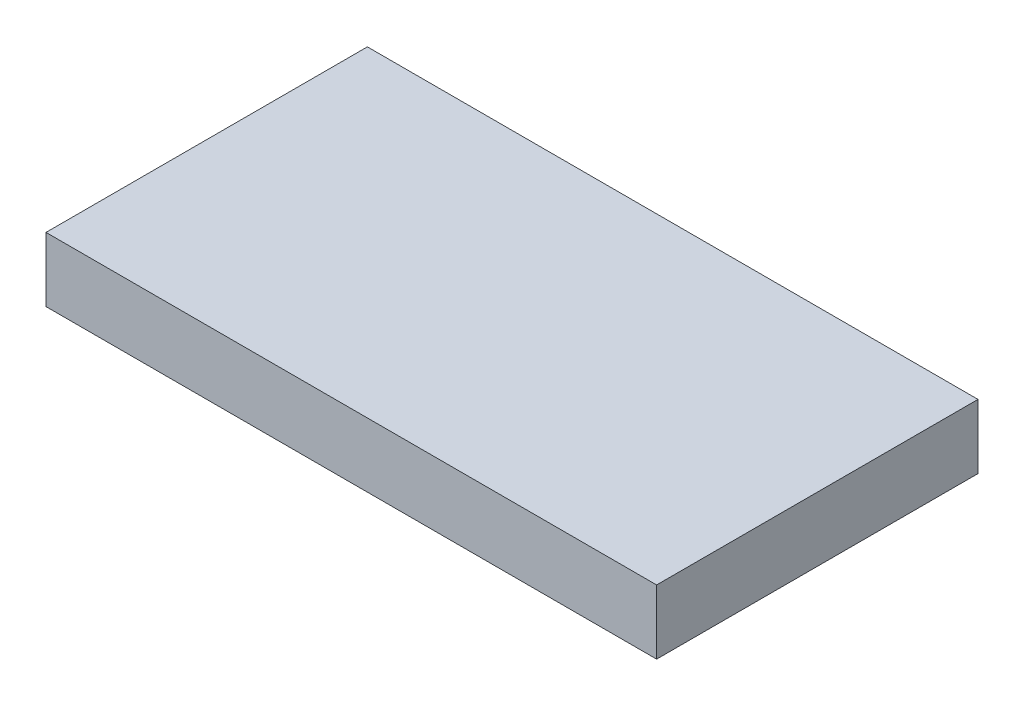
ISO-10303-21;
HEADER;
FILE_DESCRIPTION(('STEP AP214'),'2;1');
FILE_NAME('part.step','',(''),(''),'','','');
FILE_SCHEMA(('AUTOMOTIVE_DESIGN { 1 0 10303 214 1 1 1 1 }'));
ENDSEC;
DATA;
#1=APPLICATION_CONTEXT('core data for automotive mechanical design processes');
#2=APPLICATION_PROTOCOL_DEFINITION('international standard','automotive_design',2000,#1);
#3=PRODUCT_CONTEXT('',#1,'mechanical');
#4=PRODUCT('Part','Part','',(#3));
#5=PRODUCT_RELATED_PRODUCT_CATEGORY('part','',(#4));
#6=PRODUCT_DEFINITION_FORMATION('','',#4);
#7=PRODUCT_DEFINITION_CONTEXT('part definition',#1,'design');
#8=PRODUCT_DEFINITION('design','',#6,#7);
#9=PRODUCT_DEFINITION_SHAPE('','',#8);
#10=(LENGTH_UNIT() NAMED_UNIT(*) SI_UNIT(.MILLI.,.METRE.));
#11=(NAMED_UNIT(*) PLANE_ANGLE_UNIT() SI_UNIT($,.RADIAN.));
#12=(NAMED_UNIT(*) SI_UNIT($,.STERADIAN.) SOLID_ANGLE_UNIT());
#13=UNCERTAINTY_MEASURE_WITH_UNIT(LENGTH_MEASURE(1.E-05),#10,'distance_accuracy_value','');
#14=(GEOMETRIC_REPRESENTATION_CONTEXT(3) GLOBAL_UNCERTAINTY_ASSIGNED_CONTEXT((#13)) GLOBAL_UNIT_ASSIGNED_CONTEXT((#10,
#11,#12)) REPRESENTATION_CONTEXT('',''));
#15=CARTESIAN_POINT('',(0.,0.,0.));
#16=DIRECTION('',(0.,0.,1.));
#17=DIRECTION('',(1.,0.,0.));
#18=AXIS2_PLACEMENT_3D('',#15,#16,#17);
#19=CARTESIAN_POINT('',(1.,0.2,-0.5));
#20=DIRECTION('',(-1.,0.,0.));
#21=DIRECTION('',(0.,0.,1.));
#22=AXIS2_PLACEMENT_3D('',#19,#20,#21);
#23=PLANE('',#22);
#24=DIRECTION('',(0.,0.,-1.));
#25=VECTOR('',#24,1.);
#26=CARTESIAN_POINT('',(1.,0.,-0.5));
#27=LINE('',#26,#25);
#28=CARTESIAN_POINT('',(1.,0.,0.5));
#29=VERTEX_POINT('',#28);
#30=CARTESIAN_POINT('',(1.,0.,-0.5));
#31=VERTEX_POINT('',#30);
#32=EDGE_CURVE('E96',#29,#31,#27,.T.);
#33=ORIENTED_EDGE('',*,*,#32,.T.);
#34=DIRECTION('',(0.,-1.,0.));
#35=VECTOR('',#34,1.);
#36=CARTESIAN_POINT('',(1.,0.2,-0.5));
#37=LINE('',#36,#35);
#38=CARTESIAN_POINT('',(1.,0.2,-0.5));
#39=VERTEX_POINT('',#38);
#40=EDGE_CURVE('E11',#39,#31,#37,.T.);
#41=ORIENTED_EDGE('',*,*,#40,.F.);
#42=DIRECTION('',(0.,0.,-1.));
#43=VECTOR('',#42,1.);
#44=CARTESIAN_POINT('',(1.,0.2,-0.5));
#45=LINE('',#44,#43);
#46=CARTESIAN_POINT('',(1.,0.2,0.5));
#47=VERTEX_POINT('',#46);
#48=EDGE_CURVE('E84',#47,#39,#45,.T.);
#49=ORIENTED_EDGE('',*,*,#48,.F.);
#50=DIRECTION('',(0.,-1.,0.));
#51=VECTOR('',#50,1.);
#52=CARTESIAN_POINT('',(1.,0.2,0.5));
#53=LINE('',#52,#51);
#54=EDGE_CURVE('E92',#47,#29,#53,.T.);
#55=ORIENTED_EDGE('',*,*,#54,.T.);
#56=EDGE_LOOP('',(#33,#41,#49,#55));
#57=FACE_BOUND('',#56,.T.);
#58=ADVANCED_FACE('F33',(#57),#23,.F.);
#59=CARTESIAN_POINT('',(1.,0.2,-0.5));
#60=DIRECTION('',(0.,0.,1.));
#61=DIRECTION('',(1.,0.,0.));
#62=AXIS2_PLACEMENT_3D('',#59,#60,#61);
#63=PLANE('',#62);
#64=DIRECTION('',(-1.,0.,0.));
#65=VECTOR('',#64,1.);
#66=CARTESIAN_POINT('',(1.,0.,-0.5));
#67=LINE('',#66,#65);
#68=CARTESIAN_POINT('',(-0.9,0.,-0.5));
#69=VERTEX_POINT('',#68);
#70=EDGE_CURVE('E88',#31,#69,#67,.T.);
#71=ORIENTED_EDGE('',*,*,#70,.T.);
#72=DIRECTION('',(0.,-1.,0.));
#73=VECTOR('',#72,1.);
#74=CARTESIAN_POINT('',(-0.9,0.2,-0.5));
#75=LINE('',#74,#73);
#76=CARTESIAN_POINT('',(-0.9,0.2,-0.5));
#77=VERTEX_POINT('',#76);
#78=EDGE_CURVE('E41',#77,#69,#75,.T.);
#79=ORIENTED_EDGE('',*,*,#78,.F.);
#80=DIRECTION('',(-1.,0.,0.));
#81=VECTOR('',#80,1.);
#82=CARTESIAN_POINT('',(1.,0.2,-0.5));
#83=LINE('',#82,#81);
#84=EDGE_CURVE('E79',#39,#77,#83,.T.);
#85=ORIENTED_EDGE('',*,*,#84,.F.);
#86=ORIENTED_EDGE('',*,*,#40,.T.);
#87=EDGE_LOOP('',(#71,#79,#85,#86));
#88=FACE_BOUND('',#87,.T.);
#89=ADVANCED_FACE('F87',(#88),#63,.F.);
#90=CARTESIAN_POINT('',(-0.9,0.2,-0.5));
#91=DIRECTION('',(1.,0.,0.));
#92=DIRECTION('',(0.,0.,-1.));
#93=AXIS2_PLACEMENT_3D('',#90,#91,#92);
#94=PLANE('',#93);
#95=DIRECTION('',(0.,0.,1.));
#96=VECTOR('',#95,1.);
#97=CARTESIAN_POINT('',(-0.9,0.,-0.5));
#98=LINE('',#97,#96);
#99=CARTESIAN_POINT('',(-0.9,0.,0.5));
#100=VERTEX_POINT('',#99);
#101=EDGE_CURVE('E66',#69,#100,#98,.T.);
#102=ORIENTED_EDGE('',*,*,#101,.T.);
#103=DIRECTION('',(0.,-1.,0.));
#104=VECTOR('',#103,1.);
#105=CARTESIAN_POINT('',(-0.9,0.2,0.5));
#106=LINE('',#105,#104);
#107=CARTESIAN_POINT('',(-0.9,0.2,0.5));
#108=VERTEX_POINT('',#107);
#109=EDGE_CURVE('E89',#108,#100,#106,.T.);
#110=ORIENTED_EDGE('',*,*,#109,.F.);
#111=DIRECTION('',(0.,0.,1.));
#112=VECTOR('',#111,1.);
#113=CARTESIAN_POINT('',(-0.9,0.2,-0.5));
#114=LINE('',#113,#112);
#115=EDGE_CURVE('E82',#77,#108,#114,.T.);
#116=ORIENTED_EDGE('',*,*,#115,.F.);
#117=ORIENTED_EDGE('',*,*,#78,.T.);
#118=EDGE_LOOP('',(#102,#110,#116,#117));
#119=FACE_BOUND('',#118,.T.);
#120=ADVANCED_FACE('F90',(#119),#94,.F.);
#121=CARTESIAN_POINT('',(1.,0.2,0.5));
#122=DIRECTION('',(0.,0.,-1.));
#123=DIRECTION('',(-1.,0.,0.));
#124=AXIS2_PLACEMENT_3D('',#121,#122,#123);
#125=PLANE('',#124);
#126=DIRECTION('',(1.,0.,0.));
#127=VECTOR('',#126,1.);
#128=CARTESIAN_POINT('',(1.,0.,0.5));
#129=LINE('',#128,#127);
#130=EDGE_CURVE('E72',#100,#29,#129,.T.);
#131=ORIENTED_EDGE('',*,*,#130,.T.);
#132=ORIENTED_EDGE('',*,*,#54,.F.);
#133=DIRECTION('',(1.,0.,0.));
#134=VECTOR('',#133,1.);
#135=CARTESIAN_POINT('',(1.,0.2,0.5));
#136=LINE('',#135,#134);
#137=EDGE_CURVE('E49',#108,#47,#136,.T.);
#138=ORIENTED_EDGE('',*,*,#137,.F.);
#139=ORIENTED_EDGE('',*,*,#109,.T.);
#140=EDGE_LOOP('',(#131,#132,#138,#139));
#141=FACE_BOUND('',#140,.T.);
#142=ADVANCED_FACE('F103',(#141),#125,.F.);
#143=CARTESIAN_POINT('',(0.,0.2,0.));
#144=DIRECTION('',(0.,-1.,0.));
#145=DIRECTION('',(0.,0.,-1.));
#146=AXIS2_PLACEMENT_3D('',#143,#144,#145);
#147=PLANE('',#146);
#148=ORIENTED_EDGE('',*,*,#48,.T.);
#149=ORIENTED_EDGE('',*,*,#84,.T.);
#150=ORIENTED_EDGE('',*,*,#115,.T.);
#151=ORIENTED_EDGE('',*,*,#137,.T.);
#152=EDGE_LOOP('',(#148,#149,#150,#151));
#153=FACE_BOUND('',#152,.T.);
#154=ADVANCED_FACE('F80',(#153),#147,.F.);
#155=CARTESIAN_POINT('',(0.,0.,0.));
#156=DIRECTION('',(0.,-1.,0.));
#157=DIRECTION('',(0.,0.,-1.));
#158=AXIS2_PLACEMENT_3D('',#155,#156,#157);
#159=PLANE('',#158);
#160=ORIENTED_EDGE('',*,*,#32,.F.);
#161=ORIENTED_EDGE('',*,*,#130,.F.);
#162=ORIENTED_EDGE('',*,*,#101,.F.);
#163=ORIENTED_EDGE('',*,*,#70,.F.);
#164=EDGE_LOOP('',(#160,#161,#162,#163));
#165=FACE_BOUND('',#164,.T.);
#166=ADVANCED_FACE('F106',(#165),#159,.T.);
#167=CLOSED_SHELL('',(#58,#89,#120,#142,#154,#166));
#168=MANIFOLD_SOLID_BREP('B2',#167);
#169=ADVANCED_BREP_SHAPE_REPRESENTATION('',(#18,#168),#14);
#170=SHAPE_DEFINITION_REPRESENTATION(#9,#169);
ENDSEC;
END-ISO-10303-21;
